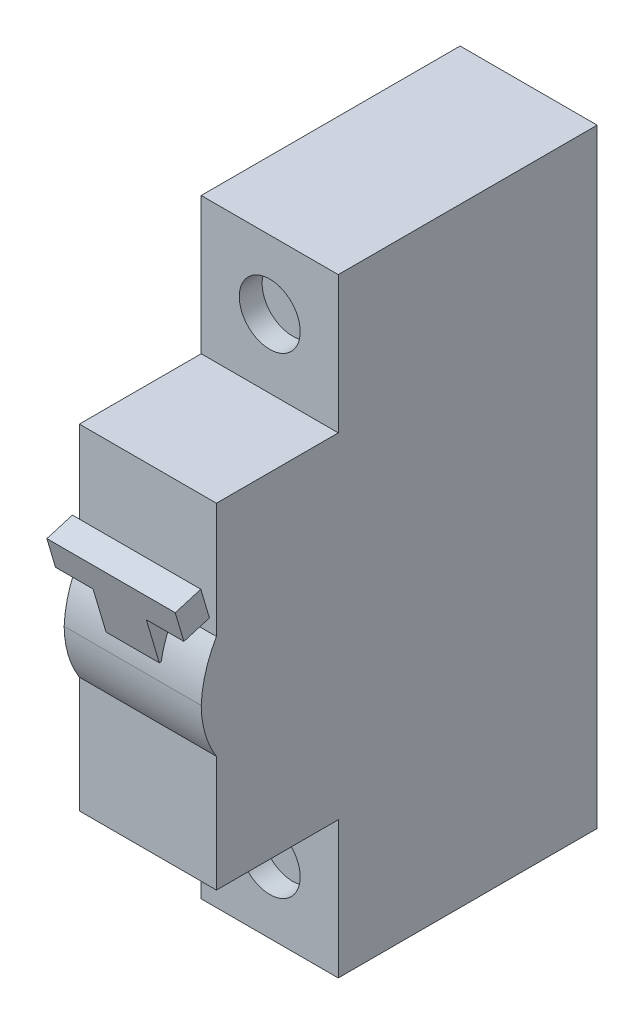
ISO-10303-21;
HEADER;
FILE_DESCRIPTION(('STEP AP214'),'2;1');
FILE_NAME('part.step','',(''),(''),'','','');
FILE_SCHEMA(('AUTOMOTIVE_DESIGN { 1 0 10303 214 1 1 1 1 }'));
ENDSEC;
DATA;
#1=APPLICATION_CONTEXT('core data for automotive mechanical design processes');
#2=APPLICATION_PROTOCOL_DEFINITION('international standard','automotive_design',2000,#1);
#3=PRODUCT_CONTEXT('',#1,'mechanical');
#4=PRODUCT('Part','Part','',(#3));
#5=PRODUCT_RELATED_PRODUCT_CATEGORY('part','',(#4));
#6=PRODUCT_DEFINITION_FORMATION('','',#4);
#7=PRODUCT_DEFINITION_CONTEXT('part definition',#1,'design');
#8=PRODUCT_DEFINITION('design','',#6,#7);
#9=PRODUCT_DEFINITION_SHAPE('','',#8);
#10=(LENGTH_UNIT() NAMED_UNIT(*) SI_UNIT(.MILLI.,.METRE.));
#11=(NAMED_UNIT(*) PLANE_ANGLE_UNIT() SI_UNIT($,.RADIAN.));
#12=(NAMED_UNIT(*) SI_UNIT($,.STERADIAN.) SOLID_ANGLE_UNIT());
#13=UNCERTAINTY_MEASURE_WITH_UNIT(LENGTH_MEASURE(1.E-05),#10,'distance_accuracy_value','');
#14=(GEOMETRIC_REPRESENTATION_CONTEXT(3) GLOBAL_UNCERTAINTY_ASSIGNED_CONTEXT((#13)) GLOBAL_UNIT_ASSIGNED_CONTEXT((#10,
#11,#12)) REPRESENTATION_CONTEXT('',''));
#15=CARTESIAN_POINT('',(0.,0.,0.));
#16=DIRECTION('',(0.,0.,1.));
#17=DIRECTION('',(1.,0.,0.));
#18=AXIS2_PLACEMENT_3D('',#15,#16,#17);
#19=CARTESIAN_POINT('',(31.7737041463469,-40.6142705725074,-12.8033959311611));
#20=DIRECTION('',(-1.,0.,0.));
#21=DIRECTION('',(0.,-1.,0.));
#22=AXIS2_PLACEMENT_3D('',#19,#20,#21);
#23=CYLINDRICAL_SURFACE('',#22,14.8161351043707);
#24=CARTESIAN_POINT('',(5.50170062037353,-40.6142705725074,-12.8033959311611));
#25=DIRECTION('',(1.,0.,0.));
#26=DIRECTION('',(0.,0.,-1.));
#27=AXIS2_PLACEMENT_3D('',#24,#25,#26);
#28=CIRCLE('',#27,14.8161351043707);
#29=CARTESIAN_POINT('',(5.50170062037353,-37.9060133718341,1.76311368391029));
#30=VERTEX_POINT('',#29);
#31=CARTESIAN_POINT('',(5.50170062037353,-33.158339238268,0.));
#32=VERTEX_POINT('',#31);
#33=EDGE_CURVE('E44',#30,#32,#28,.F.);
#34=ORIENTED_EDGE('',*,*,#33,.T.);
#35=DIRECTION('',(-1.,0.,0.));
#36=VECTOR('',#35,1.);
#37=CARTESIAN_POINT('',(31.7737041463469,-33.158339238268,0.));
#38=LINE('',#37,#36);
#39=CARTESIAN_POINT('',(0.,-33.158339238268,0.));
#40=VERTEX_POINT('',#39);
#41=EDGE_CURVE('E247',#32,#40,#38,.T.);
#42=ORIENTED_EDGE('',*,*,#41,.T.);
#43=CARTESIAN_POINT('',(0.,-40.6142705725074,-12.8033959311611));
#44=DIRECTION('',(-1.,0.,0.));
#45=DIRECTION('',(0.,-1.,0.));
#46=AXIS2_PLACEMENT_3D('',#43,#44,#45);
#47=CIRCLE('',#46,14.8161351043707);
#48=CARTESIAN_POINT('',(0.,-40.,2.));
#49=VERTEX_POINT('',#48);
#50=EDGE_CURVE('E240',#49,#40,#47,.T.);
#51=ORIENTED_EDGE('',*,*,#50,.F.);
#52=DIRECTION('',(-1.,0.,0.));
#53=VECTOR('',#52,1.);
#54=CARTESIAN_POINT('',(31.7737041463469,-40.,2.));
#55=LINE('',#54,#53);
#56=CARTESIAN_POINT('',(18.,-40.,2.));
#57=VERTEX_POINT('',#56);
#58=EDGE_CURVE('E251',#57,#49,#55,.T.);
#59=ORIENTED_EDGE('',*,*,#58,.F.);
#60=CARTESIAN_POINT('',(18.,-40.6142705725074,-12.8033959311611));
#61=DIRECTION('',(1.,0.,0.));
#62=DIRECTION('',(0.,1.,0.));
#63=AXIS2_PLACEMENT_3D('',#60,#61,#62);
#64=CIRCLE('',#63,14.8161351043707);
#65=CARTESIAN_POINT('',(18.,-33.158339238268,0.));
#66=VERTEX_POINT('',#65);
#67=EDGE_CURVE('E243',#57,#66,#64,.F.);
#68=ORIENTED_EDGE('',*,*,#67,.T.);
#69=CARTESIAN_POINT('',(12.4982993796265,-33.158339238268,0.));
#70=VERTEX_POINT('',#69);
#71=EDGE_CURVE('E255',#66,#70,#38,.T.);
#72=ORIENTED_EDGE('',*,*,#71,.T.);
#73=CARTESIAN_POINT('',(12.4982993796265,-40.6142705725074,-12.8033959311611));
#74=DIRECTION('',(-1.,0.,0.));
#75=DIRECTION('',(0.,0.,1.));
#76=AXIS2_PLACEMENT_3D('',#73,#74,#75);
#77=CIRCLE('',#76,14.8161351043707);
#78=CARTESIAN_POINT('',(12.4982993796265,-37.9060133718341,1.76311368391029));
#79=VERTEX_POINT('',#78);
#80=EDGE_CURVE('E11',#70,#79,#77,.F.);
#81=ORIENTED_EDGE('',*,*,#80,.T.);
#82=DIRECTION('',(-1.,0.,0.));
#83=VECTOR('',#82,1.);
#84=CARTESIAN_POINT('',(31.7737041463469,-37.9060133718341,1.76311368391029));
#85=LINE('',#84,#83);
#86=EDGE_CURVE('E324',#79,#30,#85,.T.);
#87=ORIENTED_EDGE('',*,*,#86,.T.);
#88=EDGE_LOOP('',(#34,#42,#51,#59,#68,#72,#81,#87));
#89=FACE_BOUND('',#88,.T.);
#90=ADVANCED_FACE('F36',(#89),#23,.T.);
#91=CARTESIAN_POINT('',(0.,0.,0.));
#92=DIRECTION('',(0.,0.,1.));
#93=DIRECTION('',(1.,0.,0.));
#94=AXIS2_PLACEMENT_3D('',#91,#92,#93);
#95=PLANE('',#94);
#96=ORIENTED_EDGE('',*,*,#41,.F.);
#97=DIRECTION('',(0.,1.,0.));
#98=VECTOR('',#97,1.);
#99=CARTESIAN_POINT('',(5.50170062037353,0.,0.));
#100=LINE('',#99,#98);
#101=CARTESIAN_POINT('',(5.50170062037353,-32.3346223897265,0.));
#102=VERTEX_POINT('',#101);
#103=EDGE_CURVE('E56',#32,#102,#100,.T.);
#104=ORIENTED_EDGE('',*,*,#103,.T.);
#105=DIRECTION('',(1.,0.,0.));
#106=VECTOR('',#105,1.);
#107=CARTESIAN_POINT('',(0.,-32.3346223897265,0.));
#108=LINE('',#107,#106);
#109=CARTESIAN_POINT('',(12.4982993796265,-32.3346223897265,0.));
#110=VERTEX_POINT('',#109);
#111=EDGE_CURVE('E51',#102,#110,#108,.T.);
#112=ORIENTED_EDGE('',*,*,#111,.T.);
#113=DIRECTION('',(0.,-1.,0.));
#114=VECTOR('',#113,1.);
#115=CARTESIAN_POINT('',(12.4982993796265,0.,0.));
#116=LINE('',#115,#114);
#117=EDGE_CURVE('E228',#110,#70,#116,.T.);
#118=ORIENTED_EDGE('',*,*,#117,.T.);
#119=ORIENTED_EDGE('',*,*,#71,.F.);
#120=DIRECTION('',(0.,1.,0.));
#121=VECTOR('',#120,1.);
#122=CARTESIAN_POINT('',(18.,0.,0.));
#123=LINE('',#122,#121);
#124=CARTESIAN_POINT('',(18.,-18.,0.));
#125=VERTEX_POINT('',#124);
#126=EDGE_CURVE('E302',#66,#125,#123,.T.);
#127=ORIENTED_EDGE('',*,*,#126,.T.);
#128=DIRECTION('',(1.,0.,0.));
#129=VECTOR('',#128,1.);
#130=CARTESIAN_POINT('',(0.,-18.,0.));
#131=LINE('',#130,#129);
#132=CARTESIAN_POINT('',(0.,-18.,0.));
#133=VERTEX_POINT('',#132);
#134=EDGE_CURVE('E308',#133,#125,#131,.T.);
#135=ORIENTED_EDGE('',*,*,#134,.F.);
#136=DIRECTION('',(0.,-1.,0.));
#137=VECTOR('',#136,1.);
#138=CARTESIAN_POINT('',(0.,0.,0.));
#139=LINE('',#138,#137);
#140=EDGE_CURVE('E299',#133,#40,#139,.T.);
#141=ORIENTED_EDGE('',*,*,#140,.T.);
#142=EDGE_LOOP('',(#96,#104,#112,#118,#119,#127,#135,#141));
#143=FACE_BOUND('',#142,.T.);
#144=ADVANCED_FACE('F331',(#143),#95,.T.);
#145=CARTESIAN_POINT('',(18.,-62.,0.));
#146=VERTEX_POINT('',#145);
#147=CARTESIAN_POINT('',(18.,-46.7860656044339,0.));
#148=VERTEX_POINT('',#147);
#149=EDGE_CURVE('E289',#146,#148,#123,.T.);
#150=ORIENTED_EDGE('',*,*,#149,.T.);
#151=DIRECTION('',(-1.,0.,0.));
#152=VECTOR('',#151,1.);
#153=CARTESIAN_POINT('',(31.7737041463469,-46.7860656044339,0.));
#154=LINE('',#153,#152);
#155=CARTESIAN_POINT('',(0.,-46.7860656044339,0.));
#156=VERTEX_POINT('',#155);
#157=EDGE_CURVE('E252',#148,#156,#154,.T.);
#158=ORIENTED_EDGE('',*,*,#157,.T.);
#159=CARTESIAN_POINT('',(0.,-62.,0.));
#160=VERTEX_POINT('',#159);
#161=EDGE_CURVE('E284',#156,#160,#139,.T.);
#162=ORIENTED_EDGE('',*,*,#161,.T.);
#163=DIRECTION('',(-1.,0.,0.));
#164=VECTOR('',#163,1.);
#165=CARTESIAN_POINT('',(0.,-62.,0.));
#166=LINE('',#165,#164);
#167=EDGE_CURVE('E321',#146,#160,#166,.T.);
#168=ORIENTED_EDGE('',*,*,#167,.F.);
#169=EDGE_LOOP('',(#150,#158,#162,#168));
#170=FACE_BOUND('',#169,.T.);
#171=ADVANCED_FACE('F406',(#170),#95,.T.);
#172=CARTESIAN_POINT('',(0.,0.,-50.));
#173=DIRECTION('',(-1.,0.,0.));
#174=DIRECTION('',(0.,-1.,0.));
#175=AXIS2_PLACEMENT_3D('',#172,#173,#174);
#176=PLANE('',#175);
#177=DIRECTION('',(0.,-1.,0.));
#178=VECTOR('',#177,1.);
#179=CARTESIAN_POINT('',(0.,-80.,-16.));
#180=LINE('',#179,#178);
#181=CARTESIAN_POINT('',(0.,-62.,-16.));
#182=VERTEX_POINT('',#181);
#183=CARTESIAN_POINT('',(0.,-80.,-16.));
#184=VERTEX_POINT('',#183);
#185=EDGE_CURVE('E262',#182,#184,#180,.T.);
#186=ORIENTED_EDGE('',*,*,#185,.F.);
#187=DIRECTION('',(0.,0.,-1.));
#188=VECTOR('',#187,1.);
#189=CARTESIAN_POINT('',(0.,-62.,0.));
#190=LINE('',#189,#188);
#191=EDGE_CURVE('E259',#160,#182,#190,.T.);
#192=ORIENTED_EDGE('',*,*,#191,.F.);
#193=ORIENTED_EDGE('',*,*,#161,.F.);
#194=CARTESIAN_POINT('',(0.,-39.8652434690131,-10.9699049268719));
#195=DIRECTION('',(-1.,0.,0.));
#196=DIRECTION('',(0.,1.,0.));
#197=AXIS2_PLACEMENT_3D('',#194,#195,#196);
#198=CIRCLE('',#197,12.9706049641001);
#199=EDGE_CURVE('E239',#156,#49,#198,.T.);
#200=ORIENTED_EDGE('',*,*,#199,.T.);
#201=ORIENTED_EDGE('',*,*,#50,.T.);
#202=ORIENTED_EDGE('',*,*,#140,.F.);
#203=DIRECTION('',(0.,0.,1.));
#204=VECTOR('',#203,1.);
#205=CARTESIAN_POINT('',(0.,-18.,0.));
#206=LINE('',#205,#204);
#207=CARTESIAN_POINT('',(0.,-18.,-16.));
#208=VERTEX_POINT('',#207);
#209=EDGE_CURVE('E276',#208,#133,#206,.T.);
#210=ORIENTED_EDGE('',*,*,#209,.F.);
#211=DIRECTION('',(0.,-1.,0.));
#212=VECTOR('',#211,1.);
#213=CARTESIAN_POINT('',(0.,0.,-16.));
#214=LINE('',#213,#212);
#215=CARTESIAN_POINT('',(0.,0.,-16.));
#216=VERTEX_POINT('',#215);
#217=EDGE_CURVE('E273',#216,#208,#214,.T.);
#218=ORIENTED_EDGE('',*,*,#217,.F.);
#219=DIRECTION('',(0.,0.,1.));
#220=VECTOR('',#219,1.);
#221=CARTESIAN_POINT('',(0.,0.,-50.));
#222=LINE('',#221,#220);
#223=CARTESIAN_POINT('',(0.,0.,-50.));
#224=VERTEX_POINT('',#223);
#225=EDGE_CURVE('E305',#224,#216,#222,.T.);
#226=ORIENTED_EDGE('',*,*,#225,.F.);
#227=DIRECTION('',(0.,-1.,0.));
#228=VECTOR('',#227,1.);
#229=CARTESIAN_POINT('',(0.,0.,-50.));
#230=LINE('',#229,#228);
#231=CARTESIAN_POINT('',(0.,-80.,-50.));
#232=VERTEX_POINT('',#231);
#233=EDGE_CURVE('E285',#224,#232,#230,.T.);
#234=ORIENTED_EDGE('',*,*,#233,.T.);
#235=DIRECTION('',(0.,0.,1.));
#236=VECTOR('',#235,1.);
#237=CARTESIAN_POINT('',(0.,-80.,-50.));
#238=LINE('',#237,#236);
#239=EDGE_CURVE('E298',#232,#184,#238,.T.);
#240=ORIENTED_EDGE('',*,*,#239,.T.);
#241=EDGE_LOOP('',(#186,#192,#193,#200,#201,#202,#210,#218,#226,#234,#240));
#242=FACE_BOUND('',#241,.T.);
#243=ADVANCED_FACE('F38',(#242),#176,.T.);
#244=CARTESIAN_POINT('',(0.,0.,-50.));
#245=DIRECTION('',(0.,1.,0.));
#246=DIRECTION('',(0.,0.,1.));
#247=AXIS2_PLACEMENT_3D('',#244,#245,#246);
#248=PLANE('',#247);
#249=DIRECTION('',(-1.,0.,0.));
#250=VECTOR('',#249,1.);
#251=CARTESIAN_POINT('',(25.,0.,-16.));
#252=LINE('',#251,#250);
#253=CARTESIAN_POINT('',(18.,0.,-16.));
#254=VERTEX_POINT('',#253);
#255=EDGE_CURVE('E278',#254,#216,#252,.T.);
#256=ORIENTED_EDGE('',*,*,#255,.F.);
#257=DIRECTION('',(0.,0.,1.));
#258=VECTOR('',#257,1.);
#259=CARTESIAN_POINT('',(18.,0.,-50.));
#260=LINE('',#259,#258);
#261=CARTESIAN_POINT('',(18.,0.,-50.));
#262=VERTEX_POINT('',#261);
#263=EDGE_CURVE('E309',#262,#254,#260,.T.);
#264=ORIENTED_EDGE('',*,*,#263,.F.);
#265=DIRECTION('',(-1.,0.,0.));
#266=VECTOR('',#265,1.);
#267=CARTESIAN_POINT('',(0.,0.,-50.));
#268=LINE('',#267,#266);
#269=EDGE_CURVE('E295',#262,#224,#268,.T.);
#270=ORIENTED_EDGE('',*,*,#269,.T.);
#271=ORIENTED_EDGE('',*,*,#225,.T.);
#272=EDGE_LOOP('',(#256,#264,#270,#271));
#273=FACE_BOUND('',#272,.T.);
#274=ADVANCED_FACE('F419',(#273),#248,.T.);
#275=CARTESIAN_POINT('',(18.,0.,-50.));
#276=DIRECTION('',(1.,0.,0.));
#277=DIRECTION('',(0.,1.,0.));
#278=AXIS2_PLACEMENT_3D('',#275,#276,#277);
#279=PLANE('',#278);
#280=DIRECTION('',(0.,1.,0.));
#281=VECTOR('',#280,1.);
#282=CARTESIAN_POINT('',(18.,0.,-16.));
#283=LINE('',#282,#281);
#284=CARTESIAN_POINT('',(18.,-80.,-16.));
#285=VERTEX_POINT('',#284);
#286=CARTESIAN_POINT('',(18.,-62.,-16.));
#287=VERTEX_POINT('',#286);
#288=EDGE_CURVE('E271',#285,#287,#283,.T.);
#289=ORIENTED_EDGE('',*,*,#288,.F.);
#290=DIRECTION('',(0.,0.,1.));
#291=VECTOR('',#290,1.);
#292=CARTESIAN_POINT('',(18.,-80.,-50.));
#293=LINE('',#292,#291);
#294=CARTESIAN_POINT('',(18.,-80.,-50.));
#295=VERTEX_POINT('',#294);
#296=EDGE_CURVE('E312',#295,#285,#293,.T.);
#297=ORIENTED_EDGE('',*,*,#296,.F.);
#298=DIRECTION('',(0.,1.,0.));
#299=VECTOR('',#298,1.);
#300=CARTESIAN_POINT('',(18.,0.,-50.));
#301=LINE('',#300,#299);
#302=EDGE_CURVE('E292',#295,#262,#301,.T.);
#303=ORIENTED_EDGE('',*,*,#302,.T.);
#304=ORIENTED_EDGE('',*,*,#263,.T.);
#305=DIRECTION('',(0.,1.,0.));
#306=VECTOR('',#305,1.);
#307=CARTESIAN_POINT('',(18.,0.,-16.));
#308=LINE('',#307,#306);
#309=CARTESIAN_POINT('',(18.,-18.,-16.));
#310=VERTEX_POINT('',#309);
#311=EDGE_CURVE('E319',#310,#254,#308,.T.);
#312=ORIENTED_EDGE('',*,*,#311,.F.);
#313=DIRECTION('',(0.,0.,-1.));
#314=VECTOR('',#313,1.);
#315=CARTESIAN_POINT('',(18.,-18.,-50.));
#316=LINE('',#315,#314);
#317=EDGE_CURVE('E281',#125,#310,#316,.T.);
#318=ORIENTED_EDGE('',*,*,#317,.F.);
#319=ORIENTED_EDGE('',*,*,#126,.F.);
#320=ORIENTED_EDGE('',*,*,#67,.F.);
#321=CARTESIAN_POINT('',(18.,-39.8652434690131,-10.9699049268719));
#322=DIRECTION('',(1.,0.,0.));
#323=DIRECTION('',(0.,1.,0.));
#324=AXIS2_PLACEMENT_3D('',#321,#322,#323);
#325=CIRCLE('',#324,12.9706049641001);
#326=EDGE_CURVE('E248',#148,#57,#325,.F.);
#327=ORIENTED_EDGE('',*,*,#326,.F.);
#328=ORIENTED_EDGE('',*,*,#149,.F.);
#329=DIRECTION('',(0.,0.,1.));
#330=VECTOR('',#329,1.);
#331=CARTESIAN_POINT('',(18.,-62.,-50.));
#332=LINE('',#331,#330);
#333=EDGE_CURVE('E268',#287,#146,#332,.T.);
#334=ORIENTED_EDGE('',*,*,#333,.F.);
#335=EDGE_LOOP('',(#289,#297,#303,#304,#312,#318,#319,#320,#327,#328,#334));
#336=FACE_BOUND('',#335,.T.);
#337=ADVANCED_FACE('F403',(#336),#279,.T.);
#338=CARTESIAN_POINT('',(0.,-80.,-50.));
#339=DIRECTION('',(0.,-1.,0.));
#340=DIRECTION('',(0.,0.,-1.));
#341=AXIS2_PLACEMENT_3D('',#338,#339,#340);
#342=PLANE('',#341);
#343=DIRECTION('',(-1.,0.,0.));
#344=VECTOR('',#343,1.);
#345=CARTESIAN_POINT('',(25.,-80.,-16.));
#346=LINE('',#345,#344);
#347=EDGE_CURVE('E265',#285,#184,#346,.T.);
#348=ORIENTED_EDGE('',*,*,#347,.T.);
#349=ORIENTED_EDGE('',*,*,#239,.F.);
#350=DIRECTION('',(1.,0.,0.));
#351=VECTOR('',#350,1.);
#352=CARTESIAN_POINT('',(0.,-80.,-50.));
#353=LINE('',#352,#351);
#354=EDGE_CURVE('E288',#232,#295,#353,.T.);
#355=ORIENTED_EDGE('',*,*,#354,.T.);
#356=ORIENTED_EDGE('',*,*,#296,.T.);
#357=EDGE_LOOP('',(#348,#349,#355,#356));
#358=FACE_BOUND('',#357,.T.);
#359=ADVANCED_FACE('F410',(#358),#342,.T.);
#360=CARTESIAN_POINT('',(0.,0.,-50.));
#361=DIRECTION('',(0.,0.,1.));
#362=DIRECTION('',(1.,0.,0.));
#363=AXIS2_PLACEMENT_3D('',#360,#361,#362);
#364=PLANE('',#363);
#365=ORIENTED_EDGE('',*,*,#233,.F.);
#366=ORIENTED_EDGE('',*,*,#269,.F.);
#367=ORIENTED_EDGE('',*,*,#302,.F.);
#368=ORIENTED_EDGE('',*,*,#354,.F.);
#369=EDGE_LOOP('',(#365,#366,#367,#368));
#370=FACE_BOUND('',#369,.T.);
#371=ADVANCED_FACE('F416',(#370),#364,.F.);
#372=CARTESIAN_POINT('',(25.,-18.,0.));
#373=DIRECTION('',(0.,-1.,0.));
#374=DIRECTION('',(0.,0.,-1.));
#375=AXIS2_PLACEMENT_3D('',#372,#373,#374);
#376=PLANE('',#375);
#377=ORIENTED_EDGE('',*,*,#317,.T.);
#378=DIRECTION('',(-1.,0.,0.));
#379=VECTOR('',#378,1.);
#380=CARTESIAN_POINT('',(25.,-18.,-16.));
#381=LINE('',#380,#379);
#382=EDGE_CURVE('E279',#310,#208,#381,.T.);
#383=ORIENTED_EDGE('',*,*,#382,.T.);
#384=ORIENTED_EDGE('',*,*,#209,.T.);
#385=ORIENTED_EDGE('',*,*,#134,.T.);
#386=EDGE_LOOP('',(#377,#383,#384,#385));
#387=FACE_BOUND('',#386,.T.);
#388=ADVANCED_FACE('F428',(#387),#376,.F.);
#389=CARTESIAN_POINT('',(25.,0.,-16.));
#390=DIRECTION('',(0.,0.,-1.));
#391=DIRECTION('',(0.,1.,0.));
#392=AXIS2_PLACEMENT_3D('',#389,#390,#391);
#393=PLANE('',#392);
#394=CARTESIAN_POINT('',(9.,-9.,-16.));
#395=DIRECTION('',(0.,0.,1.));
#396=DIRECTION('',(1.,0.,0.));
#397=AXIS2_PLACEMENT_3D('',#394,#395,#396);
#398=CIRCLE('',#397,4.);
#399=CARTESIAN_POINT('',(13.,-9.,-16.));
#400=VERTEX_POINT('',#399);
#401=EDGE_CURVE('E367',#400,#400,#398,.T.);
#402=ORIENTED_EDGE('',*,*,#401,.F.);
#403=EDGE_LOOP('',(#402));
#404=FACE_BOUND('',#403,.T.);
#405=ORIENTED_EDGE('',*,*,#311,.T.);
#406=ORIENTED_EDGE('',*,*,#255,.T.);
#407=ORIENTED_EDGE('',*,*,#217,.T.);
#408=ORIENTED_EDGE('',*,*,#382,.F.);
#409=EDGE_LOOP('',(#405,#406,#407,#408));
#410=FACE_BOUND('',#409,.T.);
#411=ADVANCED_FACE('F392',(#404,#410),#393,.F.);
#412=CARTESIAN_POINT('',(25.,-80.,-16.));
#413=DIRECTION('',(0.,0.,-1.));
#414=DIRECTION('',(-1.,0.,0.));
#415=AXIS2_PLACEMENT_3D('',#412,#413,#414);
#416=PLANE('',#415);
#417=CARTESIAN_POINT('',(9.00000000000001,-71.,-16.));
#418=DIRECTION('',(0.,0.,1.));
#419=DIRECTION('',(1.,0.,0.));
#420=AXIS2_PLACEMENT_3D('',#417,#418,#419);
#421=CIRCLE('',#420,4.);
#422=CARTESIAN_POINT('',(13.,-71.,-16.));
#423=VERTEX_POINT('',#422);
#424=EDGE_CURVE('E373',#423,#423,#421,.T.);
#425=ORIENTED_EDGE('',*,*,#424,.F.);
#426=EDGE_LOOP('',(#425));
#427=FACE_BOUND('',#426,.T.);
#428=ORIENTED_EDGE('',*,*,#288,.T.);
#429=DIRECTION('',(-1.,0.,0.));
#430=VECTOR('',#429,1.);
#431=CARTESIAN_POINT('',(25.,-62.,-16.));
#432=LINE('',#431,#430);
#433=EDGE_CURVE('E264',#287,#182,#432,.T.);
#434=ORIENTED_EDGE('',*,*,#433,.T.);
#435=ORIENTED_EDGE('',*,*,#185,.T.);
#436=ORIENTED_EDGE('',*,*,#347,.F.);
#437=EDGE_LOOP('',(#428,#434,#435,#436));
#438=FACE_BOUND('',#437,.T.);
#439=ADVANCED_FACE('F388',(#427,#438),#416,.F.);
#440=CARTESIAN_POINT('',(25.,-62.,0.));
#441=DIRECTION('',(0.,1.,0.));
#442=DIRECTION('',(-1.,0.,0.));
#443=AXIS2_PLACEMENT_3D('',#440,#441,#442);
#444=PLANE('',#443);
#445=ORIENTED_EDGE('',*,*,#333,.T.);
#446=ORIENTED_EDGE('',*,*,#167,.T.);
#447=ORIENTED_EDGE('',*,*,#191,.T.);
#448=ORIENTED_EDGE('',*,*,#433,.F.);
#449=EDGE_LOOP('',(#445,#446,#447,#448));
#450=FACE_BOUND('',#449,.T.);
#451=ADVANCED_FACE('F391',(#450),#444,.F.);
#452=CARTESIAN_POINT('',(31.7737041463469,-39.8652434690131,-10.9699049268719));
#453=DIRECTION('',(-1.,0.,0.));
#454=DIRECTION('',(0.,-1.,0.));
#455=AXIS2_PLACEMENT_3D('',#452,#453,#454);
#456=CYLINDRICAL_SURFACE('',#455,12.9706049641001);
#457=ORIENTED_EDGE('',*,*,#157,.F.);
#458=ORIENTED_EDGE('',*,*,#326,.T.);
#459=ORIENTED_EDGE('',*,*,#58,.T.);
#460=ORIENTED_EDGE('',*,*,#199,.F.);
#461=EDGE_LOOP('',(#457,#458,#459,#460));
#462=FACE_BOUND('',#461,.T.);
#463=ADVANCED_FACE('F432',(#462),#456,.T.);
#464=CARTESIAN_POINT('',(12.4982993796265,-37.9060133718341,2.));
#465=DIRECTION('',(-1.,0.,0.));
#466=DIRECTION('',(0.,0.,1.));
#467=AXIS2_PLACEMENT_3D('',#464,#465,#466);
#468=PLANE('',#467);
#469=DIRECTION('',(0.,0.,-1.));
#470=VECTOR('',#469,1.);
#471=CARTESIAN_POINT('',(12.4982993796265,-37.9060133718341,2.));
#472=LINE('',#471,#470);
#473=CARTESIAN_POINT('',(12.4982993796265,-37.9060133718341,2.));
#474=VERTEX_POINT('',#473);
#475=EDGE_CURVE('E234',#474,#79,#472,.T.);
#476=ORIENTED_EDGE('',*,*,#475,.T.);
#477=ORIENTED_EDGE('',*,*,#80,.F.);
#478=ORIENTED_EDGE('',*,*,#117,.F.);
#479=DIRECTION('',(0.,-0.958819734868193,-0.284015344703923));
#480=VECTOR('',#479,1.);
#481=CARTESIAN_POINT('',(12.4982993796265,-31.1590412561612,0.348222996184858));
#482=LINE('',#481,#480);
#483=CARTESIAN_POINT('',(12.4982993796265,-31.1590412561613,0.348222996184856));
#484=VERTEX_POINT('',#483);
#485=EDGE_CURVE('E218',#484,#110,#482,.T.);
#486=ORIENTED_EDGE('',*,*,#485,.F.);
#487=DIRECTION('',(0.,0.284015344703923,-0.958819734868193));
#488=VECTOR('',#487,1.);
#489=CARTESIAN_POINT('',(12.4982993796265,-32.153094962625,3.70409206822353));
#490=LINE('',#489,#488);
#491=CARTESIAN_POINT('',(12.4982993796265,-32.153094962625,3.70409206822353));
#492=VERTEX_POINT('',#491);
#493=EDGE_CURVE('E207',#492,#484,#490,.T.);
#494=ORIENTED_EDGE('',*,*,#493,.F.);
#495=DIRECTION('',(0.,-0.958819734868193,-0.284015344703923));
#496=VECTOR('',#495,1.);
#497=CARTESIAN_POINT('',(12.4982993796265,-32.153094962625,3.70409206822353));
#498=LINE('',#497,#496);
#499=EDGE_CURVE('E221',#492,#474,#498,.T.);
#500=ORIENTED_EDGE('',*,*,#499,.T.);
#501=EDGE_LOOP('',(#476,#477,#478,#486,#494,#500));
#502=FACE_BOUND('',#501,.T.);
#503=ADVANCED_FACE('F341',(#502),#468,.F.);
#504=CARTESIAN_POINT('',(5.50170062037353,-37.9060133718341,2.));
#505=DIRECTION('',(1.,0.,0.));
#506=DIRECTION('',(0.,0.,-1.));
#507=AXIS2_PLACEMENT_3D('',#504,#505,#506);
#508=PLANE('',#507);
#509=DIRECTION('',(0.,0.,-1.));
#510=VECTOR('',#509,1.);
#511=CARTESIAN_POINT('',(5.50170062037353,-37.9060133718341,2.));
#512=LINE('',#511,#510);
#513=CARTESIAN_POINT('',(5.50170062037353,-37.9060133718341,2.));
#514=VERTEX_POINT('',#513);
#515=EDGE_CURVE('E237',#514,#30,#512,.T.);
#516=ORIENTED_EDGE('',*,*,#515,.F.);
#517=DIRECTION('',(0.,-0.958819734868193,-0.284015344703923));
#518=VECTOR('',#517,1.);
#519=CARTESIAN_POINT('',(5.50170062037353,-32.153094962625,3.70409206822353));
#520=LINE('',#519,#518);
#521=CARTESIAN_POINT('',(5.50170062037353,-32.153094962625,3.70409206822353));
#522=VERTEX_POINT('',#521);
#523=EDGE_CURVE('E224',#522,#514,#520,.T.);
#524=ORIENTED_EDGE('',*,*,#523,.F.);
#525=DIRECTION('',(0.,-0.284015344703923,0.958819734868193));
#526=VECTOR('',#525,1.);
#527=CARTESIAN_POINT('',(5.50170062037353,-32.153094962625,3.70409206822353));
#528=LINE('',#527,#526);
#529=CARTESIAN_POINT('',(5.50170062037353,-31.1590412561612,0.348222996184858));
#530=VERTEX_POINT('',#529);
#531=EDGE_CURVE('E204',#530,#522,#528,.T.);
#532=ORIENTED_EDGE('',*,*,#531,.F.);
#533=DIRECTION('',(0.,-0.958819734868193,-0.284015344703923));
#534=VECTOR('',#533,1.);
#535=CARTESIAN_POINT('',(5.50170062037353,-31.1590412561612,0.348222996184858));
#536=LINE('',#535,#534);
#537=EDGE_CURVE('E215',#530,#102,#536,.T.);
#538=ORIENTED_EDGE('',*,*,#537,.T.);
#539=ORIENTED_EDGE('',*,*,#103,.F.);
#540=ORIENTED_EDGE('',*,*,#33,.F.);
#541=EDGE_LOOP('',(#516,#524,#532,#538,#539,#540));
#542=FACE_BOUND('',#541,.T.);
#543=ADVANCED_FACE('F334',(#542),#508,.F.);
#544=CARTESIAN_POINT('',(5.50170062037353,-37.9060133718341,2.));
#545=DIRECTION('',(0.,1.,0.));
#546=DIRECTION('',(0.,0.,1.));
#547=AXIS2_PLACEMENT_3D('',#544,#545,#546);
#548=PLANE('',#547);
#549=ORIENTED_EDGE('',*,*,#86,.F.);
#550=ORIENTED_EDGE('',*,*,#475,.F.);
#551=DIRECTION('',(1.,0.,0.));
#552=VECTOR('',#551,1.);
#553=CARTESIAN_POINT('',(5.50170062037353,-37.9060133718341,2.));
#554=LINE('',#553,#552);
#555=EDGE_CURVE('E231',#514,#474,#554,.T.);
#556=ORIENTED_EDGE('',*,*,#555,.F.);
#557=ORIENTED_EDGE('',*,*,#515,.T.);
#558=EDGE_LOOP('',(#549,#550,#556,#557));
#559=FACE_BOUND('',#558,.T.);
#560=ADVANCED_FACE('F528',(#559),#548,.F.);
#561=CARTESIAN_POINT('',(5.50170062037353,-32.153094962625,3.70409206822353));
#562=DIRECTION('',(0.,0.284015344703923,-0.958819734868193));
#563=DIRECTION('',(0.,0.958819734868193,0.284015344703923));
#564=AXIS2_PLACEMENT_3D('',#561,#562,#563);
#565=PLANE('',#564);
#566=ORIENTED_EDGE('',*,*,#555,.T.);
#567=ORIENTED_EDGE('',*,*,#499,.F.);
#568=DIRECTION('',(1.,0.,0.));
#569=VECTOR('',#568,1.);
#570=CARTESIAN_POINT('',(0.567745087331803,-32.153094962625,3.70409206822353));
#571=LINE('',#570,#569);
#572=CARTESIAN_POINT('',(17.4322549126682,-32.153094962625,3.70409206822353));
#573=VERTEX_POINT('',#572);
#574=EDGE_CURVE('E345',#492,#573,#571,.T.);
#575=ORIENTED_EDGE('',*,*,#574,.T.);
#576=DIRECTION('',(0.,-0.958819734868193,-0.284015344703923));
#577=VECTOR('',#576,1.);
#578=CARTESIAN_POINT('',(17.4322549126682,-28.3178160231522,4.84015344703922));
#579=LINE('',#578,#577);
#580=CARTESIAN_POINT('',(17.4322549126682,-28.3178160231522,4.84015344703922));
#581=VERTEX_POINT('',#580);
#582=EDGE_CURVE('E353',#581,#573,#579,.T.);
#583=ORIENTED_EDGE('',*,*,#582,.F.);
#584=DIRECTION('',(1.,0.,0.));
#585=VECTOR('',#584,1.);
#586=CARTESIAN_POINT('',(0.567745087331803,-28.3178160231522,4.84015344703922));
#587=LINE('',#586,#585);
#588=CARTESIAN_POINT('',(0.567745087331803,-28.3178160231522,4.84015344703922));
#589=VERTEX_POINT('',#588);
#590=EDGE_CURVE('E195',#589,#581,#587,.T.);
#591=ORIENTED_EDGE('',*,*,#590,.F.);
#592=DIRECTION('',(0.,-0.958819734868193,-0.284015344703923));
#593=VECTOR('',#592,1.);
#594=CARTESIAN_POINT('',(0.567745087331803,-28.3178160231522,4.84015344703922));
#595=LINE('',#594,#593);
#596=CARTESIAN_POINT('',(0.567745087331803,-32.153094962625,3.70409206822353));
#597=VERTEX_POINT('',#596);
#598=EDGE_CURVE('E209',#589,#597,#595,.T.);
#599=ORIENTED_EDGE('',*,*,#598,.T.);
#600=EDGE_CURVE('E199',#597,#522,#571,.T.);
#601=ORIENTED_EDGE('',*,*,#600,.T.);
#602=ORIENTED_EDGE('',*,*,#523,.T.);
#603=EDGE_LOOP('',(#566,#567,#575,#583,#591,#599,#601,#602));
#604=FACE_BOUND('',#603,.T.);
#605=ADVANCED_FACE('F357',(#604),#565,.F.);
#606=CARTESIAN_POINT('',(5.50170062037353,-31.1590412561612,0.348222996184858));
#607=DIRECTION('',(0.,-0.284015344703923,0.958819734868193));
#608=DIRECTION('',(0.,-0.958819734868193,-0.284015344703923));
#609=AXIS2_PLACEMENT_3D('',#606,#607,#608);
#610=PLANE('',#609);
#611=ORIENTED_EDGE('',*,*,#111,.F.);
#612=ORIENTED_EDGE('',*,*,#537,.F.);
#613=DIRECTION('',(-1.,0.,0.));
#614=VECTOR('',#613,1.);
#615=CARTESIAN_POINT('',(0.567745087331803,-31.1590412561613,0.348222996184856));
#616=LINE('',#615,#614);
#617=CARTESIAN_POINT('',(0.567745087331803,-31.1590412561613,0.348222996184856));
#618=VERTEX_POINT('',#617);
#619=EDGE_CURVE('E337',#530,#618,#616,.T.);
#620=ORIENTED_EDGE('',*,*,#619,.T.);
#621=DIRECTION('',(0.,-0.958819734868193,-0.284015344703923));
#622=VECTOR('',#621,1.);
#623=CARTESIAN_POINT('',(0.567745087331803,-27.3237623166885,1.48428437500055));
#624=LINE('',#623,#622);
#625=CARTESIAN_POINT('',(0.567745087331803,-27.3237623166885,1.48428437500055));
#626=VERTEX_POINT('',#625);
#627=EDGE_CURVE('E186',#626,#618,#624,.T.);
#628=ORIENTED_EDGE('',*,*,#627,.F.);
#629=DIRECTION('',(-1.,0.,0.));
#630=VECTOR('',#629,1.);
#631=CARTESIAN_POINT('',(0.567745087331803,-27.3237623166885,1.48428437500055));
#632=LINE('',#631,#630);
#633=CARTESIAN_POINT('',(17.4322549126682,-27.3237623166885,1.48428437500055));
#634=VERTEX_POINT('',#633);
#635=EDGE_CURVE('E178',#634,#626,#632,.T.);
#636=ORIENTED_EDGE('',*,*,#635,.F.);
#637=DIRECTION('',(0.,-0.958819734868193,-0.284015344703923));
#638=VECTOR('',#637,1.);
#639=CARTESIAN_POINT('',(17.4322549126682,-27.3237623166885,1.48428437500055));
#640=LINE('',#639,#638);
#641=CARTESIAN_POINT('',(17.4322549126682,-31.1590412561613,0.348222996184856));
#642=VERTEX_POINT('',#641);
#643=EDGE_CURVE('E183',#634,#642,#640,.T.);
#644=ORIENTED_EDGE('',*,*,#643,.T.);
#645=EDGE_CURVE('E338',#642,#484,#616,.T.);
#646=ORIENTED_EDGE('',*,*,#645,.T.);
#647=ORIENTED_EDGE('',*,*,#485,.T.);
#648=EDGE_LOOP('',(#611,#612,#620,#628,#636,#644,#646,#647));
#649=FACE_BOUND('',#648,.T.);
#650=ADVANCED_FACE('F180',(#649),#610,.F.);
#651=CARTESIAN_POINT('',(0.,-28.5507781232444,-8.45712577177312));
#652=DIRECTION('',(0.,0.958819734868193,0.284015344703923));
#653=DIRECTION('',(0.,-0.284015344703923,0.958819734868193));
#654=AXIS2_PLACEMENT_3D('',#651,#652,#653);
#655=PLANE('',#654);
#656=ORIENTED_EDGE('',*,*,#619,.F.);
#657=ORIENTED_EDGE('',*,*,#531,.T.);
#658=ORIENTED_EDGE('',*,*,#600,.F.);
#659=DIRECTION('',(0.,-0.284015344703923,0.958819734868193));
#660=VECTOR('',#659,1.);
#661=CARTESIAN_POINT('',(0.567745087331803,-31.1590412561613,0.348222996184856));
#662=LINE('',#661,#660);
#663=EDGE_CURVE('E347',#618,#597,#662,.T.);
#664=ORIENTED_EDGE('',*,*,#663,.F.);
#665=EDGE_LOOP('',(#656,#657,#658,#664));
#666=FACE_BOUND('',#665,.T.);
#667=ADVANCED_FACE('F361',(#666),#655,.F.);
#668=ORIENTED_EDGE('',*,*,#574,.F.);
#669=ORIENTED_EDGE('',*,*,#493,.T.);
#670=ORIENTED_EDGE('',*,*,#645,.F.);
#671=DIRECTION('',(0.,0.284015344703923,-0.958819734868193));
#672=VECTOR('',#671,1.);
#673=CARTESIAN_POINT('',(17.4322549126682,-31.1590412561613,0.348222996184856));
#674=LINE('',#673,#672);
#675=EDGE_CURVE('E203',#573,#642,#674,.T.);
#676=ORIENTED_EDGE('',*,*,#675,.F.);
#677=EDGE_LOOP('',(#668,#669,#670,#676));
#678=FACE_BOUND('',#677,.T.);
#679=ADVANCED_FACE('F344',(#678),#655,.F.);
#680=CARTESIAN_POINT('',(17.4322549126682,-27.3237623166885,1.48428437500055));
#681=DIRECTION('',(-1.,0.,0.));
#682=DIRECTION('',(0.,0.,1.));
#683=AXIS2_PLACEMENT_3D('',#680,#681,#682);
#684=PLANE('',#683);
#685=ORIENTED_EDGE('',*,*,#675,.T.);
#686=ORIENTED_EDGE('',*,*,#643,.F.);
#687=DIRECTION('',(0.,0.284015344703923,-0.958819734868193));
#688=VECTOR('',#687,1.);
#689=CARTESIAN_POINT('',(17.4322549126682,-27.3237623166885,1.48428437500055));
#690=LINE('',#689,#688);
#691=EDGE_CURVE('E190',#581,#634,#690,.T.);
#692=ORIENTED_EDGE('',*,*,#691,.F.);
#693=ORIENTED_EDGE('',*,*,#582,.T.);
#694=EDGE_LOOP('',(#685,#686,#692,#693));
#695=FACE_BOUND('',#694,.T.);
#696=ADVANCED_FACE('F201',(#695),#684,.F.);
#697=CARTESIAN_POINT('',(0.567745087331803,-27.3237623166885,1.48428437500055));
#698=DIRECTION('',(1.,0.,0.));
#699=DIRECTION('',(0.,0.,-1.));
#700=AXIS2_PLACEMENT_3D('',#697,#698,#699);
#701=PLANE('',#700);
#702=ORIENTED_EDGE('',*,*,#663,.T.);
#703=ORIENTED_EDGE('',*,*,#598,.F.);
#704=DIRECTION('',(0.,-0.284015344703923,0.958819734868193));
#705=VECTOR('',#704,1.);
#706=CARTESIAN_POINT('',(0.567745087331803,-27.3237623166885,1.48428437500055));
#707=LINE('',#706,#705);
#708=EDGE_CURVE('E189',#626,#589,#707,.T.);
#709=ORIENTED_EDGE('',*,*,#708,.F.);
#710=ORIENTED_EDGE('',*,*,#627,.T.);
#711=EDGE_LOOP('',(#702,#703,#709,#710));
#712=FACE_BOUND('',#711,.T.);
#713=ADVANCED_FACE('F588',(#712),#701,.F.);
#714=CARTESIAN_POINT('',(0.,-24.7154991837716,-7.32106439295743));
#715=DIRECTION('',(0.,0.958819734868193,0.284015344703923));
#716=DIRECTION('',(0.,-0.284015344703923,0.958819734868193));
#717=AXIS2_PLACEMENT_3D('',#714,#715,#716);
#718=PLANE('',#717);
#719=ORIENTED_EDGE('',*,*,#691,.T.);
#720=ORIENTED_EDGE('',*,*,#635,.T.);
#721=ORIENTED_EDGE('',*,*,#708,.T.);
#722=ORIENTED_EDGE('',*,*,#590,.T.);
#723=EDGE_LOOP('',(#719,#720,#721,#722));
#724=FACE_BOUND('',#723,.T.);
#725=ADVANCED_FACE('F193',(#724),#718,.T.);
#726=CARTESIAN_POINT('',(9.,-9.,-19.));
#727=DIRECTION('',(0.,0.,1.));
#728=DIRECTION('',(1.,0.,0.));
#729=AXIS2_PLACEMENT_3D('',#726,#727,#728);
#730=CYLINDRICAL_SURFACE('',#729,4.);
#731=CARTESIAN_POINT('',(9.,-9.,-19.));
#732=DIRECTION('',(0.,0.,1.));
#733=DIRECTION('',(1.,0.,0.));
#734=AXIS2_PLACEMENT_3D('',#731,#732,#733);
#735=CIRCLE('',#734,4.);
#736=CARTESIAN_POINT('',(13.,-9.,-19.));
#737=VERTEX_POINT('',#736);
#738=EDGE_CURVE('E362',#737,#737,#735,.T.);
#739=ORIENTED_EDGE('',*,*,#738,.F.);
#740=EDGE_LOOP('',(#739));
#741=FACE_BOUND('',#740,.T.);
#742=ORIENTED_EDGE('',*,*,#401,.T.);
#743=EDGE_LOOP('',(#742));
#744=FACE_BOUND('',#743,.T.);
#745=ADVANCED_FACE('F603',(#741,#744),#730,.F.);
#746=CARTESIAN_POINT('',(9.,-9.,-19.));
#747=DIRECTION('',(0.,0.,1.));
#748=DIRECTION('',(1.,0.,0.));
#749=AXIS2_PLACEMENT_3D('',#746,#747,#748);
#750=PLANE('',#749);
#751=ORIENTED_EDGE('',*,*,#738,.T.);
#752=EDGE_LOOP('',(#751));
#753=FACE_BOUND('',#752,.T.);
#754=ADVANCED_FACE('F384',(#753),#750,.T.);
#755=CARTESIAN_POINT('',(9.00000000000001,-71.,-19.));
#756=DIRECTION('',(0.,0.,1.));
#757=DIRECTION('',(1.,0.,0.));
#758=AXIS2_PLACEMENT_3D('',#755,#756,#757);
#759=CYLINDRICAL_SURFACE('',#758,4.);
#760=CARTESIAN_POINT('',(9.00000000000001,-71.,-19.));
#761=DIRECTION('',(0.,0.,1.));
#762=DIRECTION('',(1.,0.,0.));
#763=AXIS2_PLACEMENT_3D('',#760,#761,#762);
#764=CIRCLE('',#763,4.);
#765=CARTESIAN_POINT('',(13.,-71.,-19.));
#766=VERTEX_POINT('',#765);
#767=EDGE_CURVE('E370',#766,#766,#764,.T.);
#768=ORIENTED_EDGE('',*,*,#767,.F.);
#769=EDGE_LOOP('',(#768));
#770=FACE_BOUND('',#769,.T.);
#771=ORIENTED_EDGE('',*,*,#424,.T.);
#772=EDGE_LOOP('',(#771));
#773=FACE_BOUND('',#772,.T.);
#774=ADVANCED_FACE('F381',(#770,#773),#759,.F.);
#775=CARTESIAN_POINT('',(9.00000000000001,-71.,-19.));
#776=DIRECTION('',(0.,0.,1.));
#777=DIRECTION('',(1.,0.,0.));
#778=AXIS2_PLACEMENT_3D('',#775,#776,#777);
#779=PLANE('',#778);
#780=ORIENTED_EDGE('',*,*,#767,.T.);
#781=EDGE_LOOP('',(#780));
#782=FACE_BOUND('',#781,.T.);
#783=ADVANCED_FACE('F379',(#782),#779,.T.);
#784=CLOSED_SHELL('',(#90,#144,#171,#243,#274,#337,#359,#371,#388,#411,#439,#451,#463,#503,#543,
#560,#605,#650,#667,#679,#696,#713,#725,#745,#754,#774,#783));
#785=MANIFOLD_SOLID_BREP('B2',#784);
#786=ADVANCED_BREP_SHAPE_REPRESENTATION('',(#18,#785),#14);
#787=SHAPE_DEFINITION_REPRESENTATION(#9,#786);
ENDSEC;
END-ISO-10303-21;
